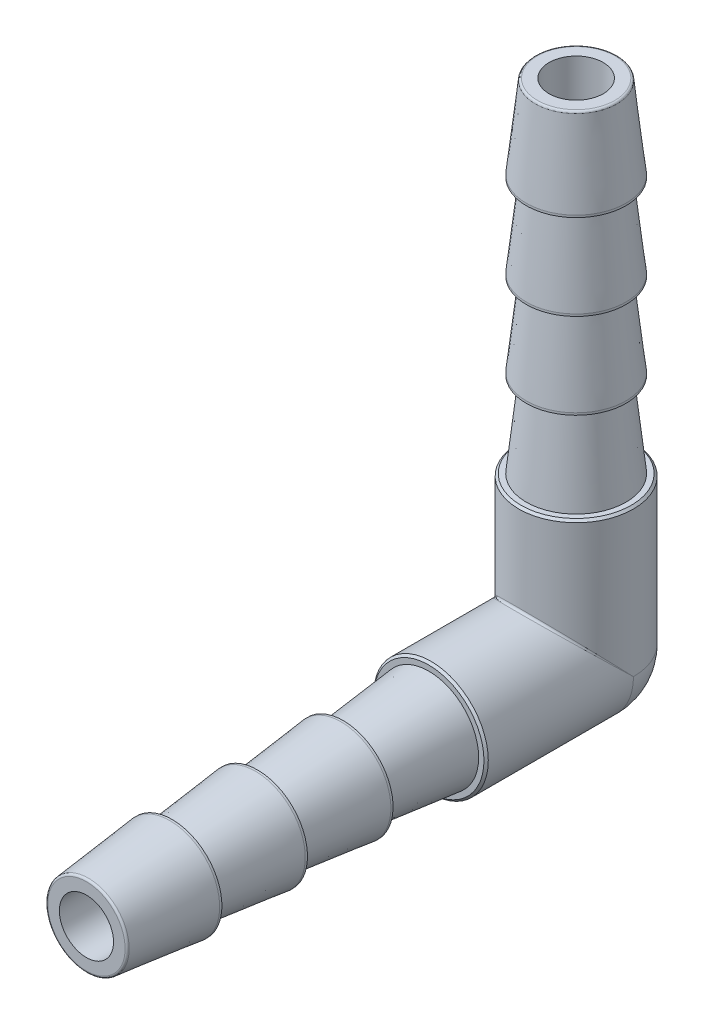
ISO-10303-21;
HEADER;
FILE_DESCRIPTION(('STEP AP214'),'2;1');
FILE_NAME('part.step','',(''),(''),'','','');
FILE_SCHEMA(('AUTOMOTIVE_DESIGN { 1 0 10303 214 1 1 1 1 }'));
ENDSEC;
DATA;
#1=APPLICATION_CONTEXT('core data for automotive mechanical design processes');
#2=APPLICATION_PROTOCOL_DEFINITION('international standard','automotive_design',2000,#1);
#3=PRODUCT_CONTEXT('',#1,'mechanical');
#4=PRODUCT('Part','Part','',(#3));
#5=PRODUCT_RELATED_PRODUCT_CATEGORY('part','',(#4));
#6=PRODUCT_DEFINITION_FORMATION('','',#4);
#7=PRODUCT_DEFINITION_CONTEXT('part definition',#1,'design');
#8=PRODUCT_DEFINITION('design','',#6,#7);
#9=PRODUCT_DEFINITION_SHAPE('','',#8);
#10=(LENGTH_UNIT() NAMED_UNIT(*) SI_UNIT(.MILLI.,.METRE.));
#11=(NAMED_UNIT(*) PLANE_ANGLE_UNIT() SI_UNIT($,.RADIAN.));
#12=(NAMED_UNIT(*) SI_UNIT($,.STERADIAN.) SOLID_ANGLE_UNIT());
#13=UNCERTAINTY_MEASURE_WITH_UNIT(LENGTH_MEASURE(1.E-05),#10,'distance_accuracy_value','');
#14=(GEOMETRIC_REPRESENTATION_CONTEXT(3) GLOBAL_UNCERTAINTY_ASSIGNED_CONTEXT((#13)) GLOBAL_UNIT_ASSIGNED_CONTEXT((#10,
#11,#12)) REPRESENTATION_CONTEXT('',''));
#15=CARTESIAN_POINT('',(0.,0.,0.));
#16=DIRECTION('',(0.,0.,1.));
#17=DIRECTION('',(1.,0.,0.));
#18=AXIS2_PLACEMENT_3D('',#15,#16,#17);
#19=CARTESIAN_POINT('',(0.,28.702,-1.00212497387476E-13));
#20=DIRECTION('',(0.,-1.,0.));
#21=DIRECTION('',(-1.,0.,0.));
#22=AXIS2_PLACEMENT_3D('',#19,#20,#21);
#23=PLANE('',#22);
#24=CARTESIAN_POINT('',(0.,28.702,-1.00212497387476E-13));
#25=DIRECTION('',(0.,-1.,0.));
#26=DIRECTION('',(0.,0.,-1.));
#27=AXIS2_PLACEMENT_3D('',#24,#25,#26);
#28=CIRCLE('',#27,2.26749802113188);
#29=CARTESIAN_POINT('',(0.,28.702,-2.26749802113198));
#30=VERTEX_POINT('',#29);
#31=EDGE_CURVE('E200',#30,#30,#28,.F.);
#32=ORIENTED_EDGE('',*,*,#31,.T.);
#33=EDGE_LOOP('',(#32));
#34=FACE_BOUND('',#33,.T.);
#35=CARTESIAN_POINT('',(0.,28.702,-1.00212497387476E-13));
#36=DIRECTION('',(0.,1.,0.));
#37=DIRECTION('',(1.,0.,0.));
#38=AXIS2_PLACEMENT_3D('',#35,#36,#37);
#39=CIRCLE('',#38,1.5875);
#40=CARTESIAN_POINT('',(1.5875,28.702,-1.00212497387476E-13));
#41=VERTEX_POINT('',#40);
#42=EDGE_CURVE('E85',#41,#41,#39,.T.);
#43=ORIENTED_EDGE('',*,*,#42,.F.);
#44=EDGE_LOOP('',(#43));
#45=FACE_BOUND('',#44,.T.);
#46=ADVANCED_FACE('F41',(#34,#45),#23,.F.);
#47=CARTESIAN_POINT('',(0.,0.,28.702));
#48=DIRECTION('',(0.,0.,1.));
#49=DIRECTION('',(1.,0.,0.));
#50=AXIS2_PLACEMENT_3D('',#47,#48,#49);
#51=CYLINDRICAL_SURFACE('',#50,1.5875);
#52=CARTESIAN_POINT('',(0.,0.,28.702));
#53=DIRECTION('',(0.,0.,1.));
#54=DIRECTION('',(1.,0.,0.));
#55=AXIS2_PLACEMENT_3D('',#52,#53,#54);
#56=CIRCLE('',#55,1.5875);
#57=CARTESIAN_POINT('',(1.5875,0.,28.702));
#58=VERTEX_POINT('',#57);
#59=EDGE_CURVE('E84',#58,#58,#56,.T.);
#60=ORIENTED_EDGE('',*,*,#59,.T.);
#61=EDGE_LOOP('',(#60));
#62=FACE_BOUND('',#61,.T.);
#63=CARTESIAN_POINT('',(0.,0.,0.));
#64=DIRECTION('',(0.,0.,1.));
#65=DIRECTION('',(1.,0.,0.));
#66=AXIS2_PLACEMENT_3D('',#63,#64,#65);
#67=CIRCLE('',#66,1.5875);
#68=CARTESIAN_POINT('',(-1.5875,0.,0.));
#69=VERTEX_POINT('',#68);
#70=CARTESIAN_POINT('',(1.5875,0.,0.));
#71=VERTEX_POINT('',#70);
#72=EDGE_CURVE('E82',#69,#71,#67,.T.);
#73=ORIENTED_EDGE('',*,*,#72,.F.);
#74=CARTESIAN_POINT('',(0.,0.,0.));
#75=DIRECTION('',(0.,-0.707106781186546,0.707106781186549));
#76=DIRECTION('',(0.,0.707106781186549,0.707106781186546));
#77=AXIS2_PLACEMENT_3D('',#74,#75,#76);
#78=ELLIPSE('',#77,2.24506403026728,1.5875);
#79=EDGE_CURVE('E71',#69,#71,#78,.F.);
#80=ORIENTED_EDGE('',*,*,#79,.T.);
#81=EDGE_LOOP('',(#73,#80));
#82=FACE_BOUND('',#81,.T.);
#83=ADVANCED_FACE('F87',(#62,#82),#51,.F.);
#84=CARTESIAN_POINT('',(0.,0.,28.702));
#85=DIRECTION('',(0.,0.,-1.));
#86=DIRECTION('',(-1.,0.,0.));
#87=AXIS2_PLACEMENT_3D('',#84,#85,#86);
#88=PLANE('',#87);
#89=CARTESIAN_POINT('',(0.,0.,28.702));
#90=DIRECTION('',(0.,0.,-1.));
#91=DIRECTION('',(-1.,0.,0.));
#92=AXIS2_PLACEMENT_3D('',#89,#90,#91);
#93=CIRCLE('',#92,2.26749802113188);
#94=CARTESIAN_POINT('',(-2.26749802113188,0.,28.702));
#95=VERTEX_POINT('',#94);
#96=EDGE_CURVE('E208',#95,#95,#93,.F.);
#97=ORIENTED_EDGE('',*,*,#96,.T.);
#98=EDGE_LOOP('',(#97));
#99=FACE_BOUND('',#98,.T.);
#100=ORIENTED_EDGE('',*,*,#59,.F.);
#101=EDGE_LOOP('',(#100));
#102=FACE_BOUND('',#101,.T.);
#103=ADVANCED_FACE('F245',(#99,#102),#88,.F.);
#104=CARTESIAN_POINT('',(0.,28.702,-1.00212497387476E-13));
#105=DIRECTION('',(0.,1.,0.));
#106=DIRECTION('',(1.,0.,0.));
#107=AXIS2_PLACEMENT_3D('',#104,#105,#106);
#108=CYLINDRICAL_SURFACE('',#107,3.35915);
#109=CARTESIAN_POINT('',(0.,8.509,0.));
#110=DIRECTION('',(0.,1.,0.));
#111=DIRECTION('',(0.,0.,1.));
#112=AXIS2_PLACEMENT_3D('',#109,#110,#111);
#113=CIRCLE('',#112,3.35915);
#114=CARTESIAN_POINT('',(0.,8.50900000000001,3.35914999999997));
#115=VERTEX_POINT('',#114);
#116=EDGE_CURVE('E78',#115,#115,#113,.F.);
#117=ORIENTED_EDGE('',*,*,#116,.T.);
#118=EDGE_LOOP('',(#117));
#119=FACE_BOUND('',#118,.T.);
#120=CARTESIAN_POINT('',(0.,0.,0.));
#121=DIRECTION('',(0.,1.,0.));
#122=DIRECTION('',(1.,0.,0.));
#123=AXIS2_PLACEMENT_3D('',#120,#121,#122);
#124=CIRCLE('',#123,3.35915);
#125=CARTESIAN_POINT('',(3.35915,0.,0.));
#126=VERTEX_POINT('',#125);
#127=CARTESIAN_POINT('',(-3.35915,0.,0.));
#128=VERTEX_POINT('',#127);
#129=EDGE_CURVE('E135',#126,#128,#124,.T.);
#130=ORIENTED_EDGE('',*,*,#129,.T.);
#131=CARTESIAN_POINT('',(0.,0.,0.));
#132=DIRECTION('',(0.,-0.693868509284947,0.720101723246573));
#133=DIRECTION('',(0.,0.720101723246574,0.693868509284947));
#134=AXIS2_PLACEMENT_3D('',#131,#132,#133);
#135=ELLIPSE('',#134,4.84119102546057,3.35915);
#136=EDGE_CURVE('E55',#128,#126,#135,.F.);
#137=ORIENTED_EDGE('',*,*,#136,.T.);
#138=EDGE_LOOP('',(#130,#137));
#139=FACE_BOUND('',#138,.T.);
#140=ADVANCED_FACE('F217',(#119,#139),#108,.T.);
#141=CARTESIAN_POINT('',(0.,0.,28.702));
#142=DIRECTION('',(0.,0.,1.));
#143=DIRECTION('',(1.,0.,0.));
#144=AXIS2_PLACEMENT_3D('',#141,#142,#143);
#145=CYLINDRICAL_SURFACE('',#144,3.35915);
#146=CARTESIAN_POINT('',(0.,0.,8.50899999999999));
#147=DIRECTION('',(0.,0.,1.));
#148=DIRECTION('',(1.,0.,0.));
#149=AXIS2_PLACEMENT_3D('',#146,#147,#148);
#150=CIRCLE('',#149,3.35915);
#151=CARTESIAN_POINT('',(3.35915,0.,8.50899999999999));
#152=VERTEX_POINT('',#151);
#153=EDGE_CURVE('E186',#152,#152,#150,.F.);
#154=ORIENTED_EDGE('',*,*,#153,.T.);
#155=EDGE_LOOP('',(#154));
#156=FACE_BOUND('',#155,.T.);
#157=CARTESIAN_POINT('',(0.,0.,0.));
#158=DIRECTION('',(0.,0.,1.));
#159=DIRECTION('',(1.,0.,0.));
#160=AXIS2_PLACEMENT_3D('',#157,#158,#159);
#161=CIRCLE('',#160,3.35915);
#162=EDGE_CURVE('E179',#128,#126,#161,.T.);
#163=ORIENTED_EDGE('',*,*,#162,.T.);
#164=CARTESIAN_POINT('',(0.,0.,0.));
#165=DIRECTION('',(0.,-0.720101723246571,0.69386850928495));
#166=DIRECTION('',(0.,0.69386850928495,0.720101723246571));
#167=AXIS2_PLACEMENT_3D('',#164,#165,#166);
#168=ELLIPSE('',#167,4.84119102546057,3.35915);
#169=EDGE_CURVE('E11',#126,#128,#168,.T.);
#170=ORIENTED_EDGE('',*,*,#169,.T.);
#171=EDGE_LOOP('',(#163,#170));
#172=FACE_BOUND('',#171,.T.);
#173=ADVANCED_FACE('F220',(#156,#172),#145,.T.);
#174=CARTESIAN_POINT('',(0.,0.,18.796));
#175=DIRECTION('',(0.,0.,-1.));
#176=DIRECTION('',(-1.,0.,0.));
#177=AXIS2_PLACEMENT_3D('',#174,#175,#176);
#178=CONICAL_SURFACE('',#177,2.921,0.109944462919684);
#179=CARTESIAN_POINT('',(0.,0.,23.6855));
#180=DIRECTION('',(0.,0.,-1.));
#181=DIRECTION('',(-1.,0.,0.));
#182=AXIS2_PLACEMENT_3D('',#179,#180,#181);
#183=CIRCLE('',#182,2.38125);
#184=CARTESIAN_POINT('',(-2.38125,0.,23.6855));
#185=VERTEX_POINT('',#184);
#186=EDGE_CURVE('E151',#185,#185,#183,.T.);
#187=ORIENTED_EDGE('',*,*,#186,.T.);
#188=EDGE_LOOP('',(#187));
#189=FACE_BOUND('',#188,.T.);
#190=CARTESIAN_POINT('',(0.,0.,18.796));
#191=DIRECTION('',(0.,0.,-1.));
#192=DIRECTION('',(-1.,0.,0.));
#193=AXIS2_PLACEMENT_3D('',#190,#191,#192);
#194=CIRCLE('',#193,2.921);
#195=CARTESIAN_POINT('',(-2.921,0.,18.796));
#196=VERTEX_POINT('',#195);
#197=EDGE_CURVE('E159',#196,#196,#194,.T.);
#198=ORIENTED_EDGE('',*,*,#197,.F.);
#199=EDGE_LOOP('',(#198));
#200=FACE_BOUND('',#199,.T.);
#201=ADVANCED_FACE('F272',(#189,#200),#178,.T.);
#202=CARTESIAN_POINT('',(0.,0.,3.61949999999999));
#203=DIRECTION('',(0.,0.,-1.));
#204=DIRECTION('',(-1.,0.,0.));
#205=AXIS2_PLACEMENT_3D('',#202,#203,#204);
#206=CYLINDRICAL_SURFACE('',#205,2.921);
#207=ORIENTED_EDGE('',*,*,#197,.T.);
#208=EDGE_LOOP('',(#207));
#209=FACE_BOUND('',#208,.T.);
#210=CARTESIAN_POINT('',(0.,0.,18.669));
#211=DIRECTION('',(0.,0.,-1.));
#212=DIRECTION('',(-1.,0.,0.));
#213=AXIS2_PLACEMENT_3D('',#210,#211,#212);
#214=CIRCLE('',#213,2.921);
#215=CARTESIAN_POINT('',(-2.921,0.,18.669));
#216=VERTEX_POINT('',#215);
#217=EDGE_CURVE('E155',#216,#216,#214,.T.);
#218=ORIENTED_EDGE('',*,*,#217,.F.);
#219=EDGE_LOOP('',(#218));
#220=FACE_BOUND('',#219,.T.);
#221=ADVANCED_FACE('F268',(#209,#220),#206,.T.);
#222=CARTESIAN_POINT('',(0.,2.38125,18.669));
#223=DIRECTION('',(0.,0.,-1.));
#224=DIRECTION('',(-1.,0.,0.));
#225=AXIS2_PLACEMENT_3D('',#222,#223,#224);
#226=PLANE('',#225);
#227=ORIENTED_EDGE('',*,*,#217,.T.);
#228=EDGE_LOOP('',(#227));
#229=FACE_BOUND('',#228,.T.);
#230=CARTESIAN_POINT('',(0.,0.,18.669));
#231=DIRECTION('',(0.,0.,-1.));
#232=DIRECTION('',(-1.,0.,0.));
#233=AXIS2_PLACEMENT_3D('',#230,#231,#232);
#234=CIRCLE('',#233,2.38125);
#235=CARTESIAN_POINT('',(-2.38125,0.,18.669));
#236=VERTEX_POINT('',#235);
#237=EDGE_CURVE('E139',#236,#236,#234,.T.);
#238=ORIENTED_EDGE('',*,*,#237,.F.);
#239=EDGE_LOOP('',(#238));
#240=FACE_BOUND('',#239,.T.);
#241=ADVANCED_FACE('F264',(#229,#240),#226,.T.);
#242=CARTESIAN_POINT('',(0.,0.,23.8125));
#243=DIRECTION('',(0.,0.,-1.));
#244=DIRECTION('',(-1.,0.,0.));
#245=AXIS2_PLACEMENT_3D('',#242,#243,#244);
#246=CONICAL_SURFACE('',#245,2.921,0.109944462919684);
#247=CARTESIAN_POINT('',(0.,0.,28.5889348336045));
#248=DIRECTION('',(0.,0.,-1.));
#249=DIRECTION('',(-1.,0.,0.));
#250=AXIS2_PLACEMENT_3D('',#247,#248,#249);
#251=CIRCLE('',#250,2.39373121966703);
#252=CARTESIAN_POINT('',(-2.39373121966703,0.,28.5889348336045));
#253=VERTEX_POINT('',#252);
#254=EDGE_CURVE('E204',#253,#253,#251,.T.);
#255=ORIENTED_EDGE('',*,*,#254,.T.);
#256=EDGE_LOOP('',(#255));
#257=FACE_BOUND('',#256,.T.);
#258=CARTESIAN_POINT('',(0.,0.,23.8125));
#259=DIRECTION('',(0.,0.,-1.));
#260=DIRECTION('',(-1.,0.,0.));
#261=AXIS2_PLACEMENT_3D('',#258,#259,#260);
#262=CIRCLE('',#261,2.921);
#263=CARTESIAN_POINT('',(-2.921,0.,23.8125));
#264=VERTEX_POINT('',#263);
#265=EDGE_CURVE('E167',#264,#264,#262,.T.);
#266=ORIENTED_EDGE('',*,*,#265,.F.);
#267=EDGE_LOOP('',(#266));
#268=FACE_BOUND('',#267,.T.);
#269=ADVANCED_FACE('F267',(#257,#268),#246,.T.);
#270=CARTESIAN_POINT('',(0.,0.,8.63599999999999));
#271=DIRECTION('',(0.,0.,-1.));
#272=DIRECTION('',(-1.,0.,0.));
#273=AXIS2_PLACEMENT_3D('',#270,#271,#272);
#274=CYLINDRICAL_SURFACE('',#273,2.921);
#275=ORIENTED_EDGE('',*,*,#265,.T.);
#276=EDGE_LOOP('',(#275));
#277=FACE_BOUND('',#276,.T.);
#278=CARTESIAN_POINT('',(0.,0.,23.6855));
#279=DIRECTION('',(0.,0.,-1.));
#280=DIRECTION('',(-1.,0.,0.));
#281=AXIS2_PLACEMENT_3D('',#278,#279,#280);
#282=CIRCLE('',#281,2.921);
#283=CARTESIAN_POINT('',(-2.921,0.,23.6855));
#284=VERTEX_POINT('',#283);
#285=EDGE_CURVE('E163',#284,#284,#282,.T.);
#286=ORIENTED_EDGE('',*,*,#285,.F.);
#287=EDGE_LOOP('',(#286));
#288=FACE_BOUND('',#287,.T.);
#289=ADVANCED_FACE('F279',(#277,#288),#274,.T.);
#290=CARTESIAN_POINT('',(0.,2.38125,23.6855));
#291=DIRECTION('',(0.,0.,-1.));
#292=DIRECTION('',(-1.,0.,0.));
#293=AXIS2_PLACEMENT_3D('',#290,#291,#292);
#294=PLANE('',#293);
#295=ORIENTED_EDGE('',*,*,#285,.T.);
#296=EDGE_LOOP('',(#295));
#297=FACE_BOUND('',#296,.T.);
#298=ORIENTED_EDGE('',*,*,#186,.F.);
#299=EDGE_LOOP('',(#298));
#300=FACE_BOUND('',#299,.T.);
#301=ADVANCED_FACE('F262',(#297,#300),#294,.T.);
#302=CARTESIAN_POINT('',(0.,0.,13.7795));
#303=DIRECTION('',(0.,0.,-1.));
#304=DIRECTION('',(-1.,0.,0.));
#305=AXIS2_PLACEMENT_3D('',#302,#303,#304);
#306=CONICAL_SURFACE('',#305,2.921,0.109944462919684);
#307=ORIENTED_EDGE('',*,*,#237,.T.);
#308=EDGE_LOOP('',(#307));
#309=FACE_BOUND('',#308,.T.);
#310=CARTESIAN_POINT('',(0.,0.,13.7795));
#311=DIRECTION('',(0.,0.,-1.));
#312=DIRECTION('',(-1.,0.,0.));
#313=AXIS2_PLACEMENT_3D('',#310,#311,#312);
#314=CIRCLE('',#313,2.921);
#315=CARTESIAN_POINT('',(-2.921,0.,13.7795));
#316=VERTEX_POINT('',#315);
#317=EDGE_CURVE('E147',#316,#316,#314,.T.);
#318=ORIENTED_EDGE('',*,*,#317,.F.);
#319=EDGE_LOOP('',(#318));
#320=FACE_BOUND('',#319,.T.);
#321=ADVANCED_FACE('F258',(#309,#320),#306,.T.);
#322=CARTESIAN_POINT('',(0.,0.,-1.39700000000001));
#323=DIRECTION('',(0.,0.,-1.));
#324=DIRECTION('',(-1.,0.,0.));
#325=AXIS2_PLACEMENT_3D('',#322,#323,#324);
#326=CYLINDRICAL_SURFACE('',#325,2.921);
#327=ORIENTED_EDGE('',*,*,#317,.T.);
#328=EDGE_LOOP('',(#327));
#329=FACE_BOUND('',#328,.T.);
#330=CARTESIAN_POINT('',(0.,0.,13.6525));
#331=DIRECTION('',(0.,0.,-1.));
#332=DIRECTION('',(-1.,0.,0.));
#333=AXIS2_PLACEMENT_3D('',#330,#331,#332);
#334=CIRCLE('',#333,2.921);
#335=CARTESIAN_POINT('',(-2.921,0.,13.6525));
#336=VERTEX_POINT('',#335);
#337=EDGE_CURVE('E143',#336,#336,#334,.T.);
#338=ORIENTED_EDGE('',*,*,#337,.F.);
#339=EDGE_LOOP('',(#338));
#340=FACE_BOUND('',#339,.T.);
#341=ADVANCED_FACE('F234',(#329,#340),#326,.T.);
#342=CARTESIAN_POINT('',(0.,2.38125,13.6525));
#343=DIRECTION('',(0.,0.,-1.));
#344=DIRECTION('',(-1.,0.,0.));
#345=AXIS2_PLACEMENT_3D('',#342,#343,#344);
#346=PLANE('',#345);
#347=ORIENTED_EDGE('',*,*,#337,.T.);
#348=EDGE_LOOP('',(#347));
#349=FACE_BOUND('',#348,.T.);
#350=CARTESIAN_POINT('',(0.,0.,13.6525));
#351=DIRECTION('',(0.,0.,1.));
#352=DIRECTION('',(1.,0.,0.));
#353=AXIS2_PLACEMENT_3D('',#350,#351,#352);
#354=CIRCLE('',#353,2.38125);
#355=CARTESIAN_POINT('',(2.38125,0.,13.6525));
#356=VERTEX_POINT('',#355);
#357=EDGE_CURVE('E175',#356,#356,#354,.T.);
#358=ORIENTED_EDGE('',*,*,#357,.T.);
#359=EDGE_LOOP('',(#358));
#360=FACE_BOUND('',#359,.T.);
#361=ADVANCED_FACE('F225',(#349,#360),#346,.T.);
#362=CARTESIAN_POINT('',(0.,0.,0.));
#363=DIRECTION('',(0.,0.,1.));
#364=DIRECTION('',(0.,1.,0.));
#365=AXIS2_PLACEMENT_3D('',#362,#363,#364);
#366=SPHERICAL_SURFACE('',#365,3.35915);
#367=ORIENTED_EDGE('',*,*,#162,.F.);
#368=ORIENTED_EDGE('',*,*,#129,.F.);
#369=EDGE_LOOP('',(#367,#368));
#370=FACE_BOUND('',#369,.T.);
#371=ADVANCED_FACE('F222',(#370),#366,.T.);
#372=CARTESIAN_POINT('',(0.,2.921,8.63599999999999));
#373=DIRECTION('',(0.,0.,1.));
#374=DIRECTION('',(1.,0.,0.));
#375=AXIS2_PLACEMENT_3D('',#372,#373,#374);
#376=PLANE('',#375);
#377=CARTESIAN_POINT('',(0.,0.,8.63599999999999));
#378=DIRECTION('',(0.,0.,1.));
#379=DIRECTION('',(1.,0.,0.));
#380=AXIS2_PLACEMENT_3D('',#377,#378,#379);
#381=CIRCLE('',#380,3.23214999999999);
#382=CARTESIAN_POINT('',(3.23214999999999,0.,8.63599999999999));
#383=VERTEX_POINT('',#382);
#384=EDGE_CURVE('E182',#383,#383,#381,.T.);
#385=ORIENTED_EDGE('',*,*,#384,.T.);
#386=EDGE_LOOP('',(#385));
#387=FACE_BOUND('',#386,.T.);
#388=CARTESIAN_POINT('',(0.,0.,8.63599999999999));
#389=DIRECTION('',(0.,0.,1.));
#390=DIRECTION('',(1.,0.,0.));
#391=AXIS2_PLACEMENT_3D('',#388,#389,#390);
#392=CIRCLE('',#391,2.921);
#393=CARTESIAN_POINT('',(2.921,0.,8.63599999999999));
#394=VERTEX_POINT('',#393);
#395=EDGE_CURVE('E171',#394,#394,#392,.T.);
#396=ORIENTED_EDGE('',*,*,#395,.F.);
#397=EDGE_LOOP('',(#396));
#398=FACE_BOUND('',#397,.T.);
#399=ADVANCED_FACE('F224',(#387,#398),#376,.T.);
#400=CARTESIAN_POINT('',(0.,0.,13.6525));
#401=DIRECTION('',(0.,0.,-1.));
#402=DIRECTION('',(-1.,0.,0.));
#403=AXIS2_PLACEMENT_3D('',#400,#401,#402);
#404=CONICAL_SURFACE('',#403,2.38125,0.10718259999368);
#405=ORIENTED_EDGE('',*,*,#395,.T.);
#406=EDGE_LOOP('',(#405));
#407=FACE_BOUND('',#406,.T.);
#408=ORIENTED_EDGE('',*,*,#357,.F.);
#409=EDGE_LOOP('',(#408));
#410=FACE_BOUND('',#409,.T.);
#411=ADVANCED_FACE('F231',(#407,#410),#404,.T.);
#412=CARTESIAN_POINT('',(0.,0.,8.63599999999999));
#413=DIRECTION('',(0.,0.,-1.));
#414=DIRECTION('',(-1.,0.,0.));
#415=AXIS2_PLACEMENT_3D('',#412,#413,#414);
#416=CONICAL_SURFACE('',#415,3.23214999999999,0.785398163397472);
#417=ORIENTED_EDGE('',*,*,#153,.F.);
#418=EDGE_LOOP('',(#417));
#419=FACE_BOUND('',#418,.T.);
#420=ORIENTED_EDGE('',*,*,#384,.F.);
#421=EDGE_LOOP('',(#420));
#422=FACE_BOUND('',#421,.T.);
#423=ADVANCED_FACE('F287',(#419,#422),#416,.T.);
#424=CARTESIAN_POINT('',(0.,13.6525,0.));
#425=DIRECTION('',(0.,-1.,0.));
#426=DIRECTION('',(-1.,0.,0.));
#427=AXIS2_PLACEMENT_3D('',#424,#425,#426);
#428=CONICAL_SURFACE('',#427,2.38125,0.10718259999368);
#429=CARTESIAN_POINT('',(0.,8.63599999999999,0.));
#430=DIRECTION('',(0.,1.,0.));
#431=DIRECTION('',(1.,0.,0.));
#432=AXIS2_PLACEMENT_3D('',#429,#430,#431);
#433=CIRCLE('',#432,2.921);
#434=CARTESIAN_POINT('',(2.921,8.63599999999999,0.));
#435=VERTEX_POINT('',#434);
#436=EDGE_CURVE('E127',#435,#435,#433,.T.);
#437=ORIENTED_EDGE('',*,*,#436,.T.);
#438=EDGE_LOOP('',(#437));
#439=FACE_BOUND('',#438,.T.);
#440=CARTESIAN_POINT('',(0.,13.6525,0.));
#441=DIRECTION('',(0.,1.,0.));
#442=DIRECTION('',(1.,0.,0.));
#443=AXIS2_PLACEMENT_3D('',#440,#441,#442);
#444=CIRCLE('',#443,2.38125);
#445=CARTESIAN_POINT('',(2.38125,13.6525,0.));
#446=VERTEX_POINT('',#445);
#447=EDGE_CURVE('E131',#446,#446,#444,.T.);
#448=ORIENTED_EDGE('',*,*,#447,.F.);
#449=EDGE_LOOP('',(#448));
#450=FACE_BOUND('',#449,.T.);
#451=ADVANCED_FACE('F250',(#439,#450),#428,.T.);
#452=CARTESIAN_POINT('',(0.,8.63599999999998,-2.92100000000003));
#453=DIRECTION('',(0.,1.,0.));
#454=DIRECTION('',(1.,0.,0.));
#455=AXIS2_PLACEMENT_3D('',#452,#453,#454);
#456=PLANE('',#455);
#457=CARTESIAN_POINT('',(0.,8.63599999999999,0.));
#458=DIRECTION('',(0.,1.,0.));
#459=DIRECTION('',(0.,0.,1.));
#460=AXIS2_PLACEMENT_3D('',#457,#458,#459);
#461=CIRCLE('',#460,3.23215000000001);
#462=CARTESIAN_POINT('',(0.,8.63600000000001,3.23214999999998));
#463=VERTEX_POINT('',#462);
#464=EDGE_CURVE('E190',#463,#463,#461,.T.);
#465=ORIENTED_EDGE('',*,*,#464,.T.);
#466=EDGE_LOOP('',(#465));
#467=FACE_BOUND('',#466,.T.);
#468=ORIENTED_EDGE('',*,*,#436,.F.);
#469=EDGE_LOOP('',(#468));
#470=FACE_BOUND('',#469,.T.);
#471=ADVANCED_FACE('F302',(#467,#470),#456,.T.);
#472=CARTESIAN_POINT('',(0.,13.7795,0.));
#473=DIRECTION('',(0.,-1.,0.));
#474=DIRECTION('',(-1.,0.,0.));
#475=AXIS2_PLACEMENT_3D('',#472,#473,#474);
#476=CONICAL_SURFACE('',#475,2.921,0.109944462919684);
#477=CARTESIAN_POINT('',(0.,18.669,0.));
#478=DIRECTION('',(0.,-1.,0.));
#479=DIRECTION('',(-1.,0.,0.));
#480=AXIS2_PLACEMENT_3D('',#477,#478,#479);
#481=CIRCLE('',#480,2.38125);
#482=CARTESIAN_POINT('',(-2.38125,18.669,0.));
#483=VERTEX_POINT('',#482);
#484=EDGE_CURVE('E89',#483,#483,#481,.T.);
#485=ORIENTED_EDGE('',*,*,#484,.T.);
#486=EDGE_LOOP('',(#485));
#487=FACE_BOUND('',#486,.T.);
#488=CARTESIAN_POINT('',(0.,13.7795,0.));
#489=DIRECTION('',(0.,-1.,0.));
#490=DIRECTION('',(-1.,0.,0.));
#491=AXIS2_PLACEMENT_3D('',#488,#489,#490);
#492=CIRCLE('',#491,2.921);
#493=CARTESIAN_POINT('',(-2.921,13.7795,0.));
#494=VERTEX_POINT('',#493);
#495=EDGE_CURVE('E103',#494,#494,#492,.T.);
#496=ORIENTED_EDGE('',*,*,#495,.F.);
#497=EDGE_LOOP('',(#496));
#498=FACE_BOUND('',#497,.T.);
#499=ADVANCED_FACE('F421',(#487,#498),#476,.T.);
#500=CARTESIAN_POINT('',(0.,-1.39700000000001,0.));
#501=DIRECTION('',(0.,-1.,0.));
#502=DIRECTION('',(-1.,0.,0.));
#503=AXIS2_PLACEMENT_3D('',#500,#501,#502);
#504=CYLINDRICAL_SURFACE('',#503,2.921);
#505=ORIENTED_EDGE('',*,*,#495,.T.);
#506=EDGE_LOOP('',(#505));
#507=FACE_BOUND('',#506,.T.);
#508=CARTESIAN_POINT('',(0.,13.6525,0.));
#509=DIRECTION('',(0.,-1.,0.));
#510=DIRECTION('',(-1.,0.,0.));
#511=AXIS2_PLACEMENT_3D('',#508,#509,#510);
#512=CIRCLE('',#511,2.921);
#513=CARTESIAN_POINT('',(-2.921,13.6525,0.));
#514=VERTEX_POINT('',#513);
#515=EDGE_CURVE('E95',#514,#514,#512,.T.);
#516=ORIENTED_EDGE('',*,*,#515,.F.);
#517=EDGE_LOOP('',(#516));
#518=FACE_BOUND('',#517,.T.);
#519=ADVANCED_FACE('F431',(#507,#518),#504,.T.);
#520=CARTESIAN_POINT('',(0.,13.6525,-2.38125000000005));
#521=DIRECTION('',(0.,-1.,0.));
#522=DIRECTION('',(-1.,0.,0.));
#523=AXIS2_PLACEMENT_3D('',#520,#521,#522);
#524=PLANE('',#523);
#525=ORIENTED_EDGE('',*,*,#515,.T.);
#526=EDGE_LOOP('',(#525));
#527=FACE_BOUND('',#526,.T.);
#528=ORIENTED_EDGE('',*,*,#447,.T.);
#529=EDGE_LOOP('',(#528));
#530=FACE_BOUND('',#529,.T.);
#531=ADVANCED_FACE('F442',(#527,#530),#524,.T.);
#532=CARTESIAN_POINT('',(0.,23.8125,0.));
#533=DIRECTION('',(0.,-1.,0.));
#534=DIRECTION('',(-1.,0.,0.));
#535=AXIS2_PLACEMENT_3D('',#532,#533,#534);
#536=CONICAL_SURFACE('',#535,2.921,0.109944462919684);
#537=CARTESIAN_POINT('',(0.,28.5889348336045,0.));
#538=DIRECTION('',(0.,-1.,0.));
#539=DIRECTION('',(0.,0.,-1.));
#540=AXIS2_PLACEMENT_3D('',#537,#538,#539);
#541=CIRCLE('',#540,2.39373121966703);
#542=CARTESIAN_POINT('',(0.,28.5889348336045,-2.39373121966713));
#543=VERTEX_POINT('',#542);
#544=EDGE_CURVE('E77',#543,#543,#541,.T.);
#545=ORIENTED_EDGE('',*,*,#544,.T.);
#546=EDGE_LOOP('',(#545));
#547=FACE_BOUND('',#546,.T.);
#548=CARTESIAN_POINT('',(0.,23.8125,0.));
#549=DIRECTION('',(0.,-1.,0.));
#550=DIRECTION('',(-1.,0.,0.));
#551=AXIS2_PLACEMENT_3D('',#548,#549,#550);
#552=CIRCLE('',#551,2.921);
#553=CARTESIAN_POINT('',(-2.921,23.8125,0.));
#554=VERTEX_POINT('',#553);
#555=EDGE_CURVE('E123',#554,#554,#552,.T.);
#556=ORIENTED_EDGE('',*,*,#555,.F.);
#557=EDGE_LOOP('',(#556));
#558=FACE_BOUND('',#557,.T.);
#559=ADVANCED_FACE('F452',(#547,#558),#536,.T.);
#560=CARTESIAN_POINT('',(0.,8.63599999999999,0.));
#561=DIRECTION('',(0.,-1.,0.));
#562=DIRECTION('',(-1.,0.,0.));
#563=AXIS2_PLACEMENT_3D('',#560,#561,#562);
#564=CYLINDRICAL_SURFACE('',#563,2.921);
#565=ORIENTED_EDGE('',*,*,#555,.T.);
#566=EDGE_LOOP('',(#565));
#567=FACE_BOUND('',#566,.T.);
#568=CARTESIAN_POINT('',(0.,23.6855,0.));
#569=DIRECTION('',(0.,-1.,0.));
#570=DIRECTION('',(-1.,0.,0.));
#571=AXIS2_PLACEMENT_3D('',#568,#569,#570);
#572=CIRCLE('',#571,2.921);
#573=CARTESIAN_POINT('',(-2.921,23.6855,0.));
#574=VERTEX_POINT('',#573);
#575=EDGE_CURVE('E119',#574,#574,#572,.T.);
#576=ORIENTED_EDGE('',*,*,#575,.F.);
#577=EDGE_LOOP('',(#576));
#578=FACE_BOUND('',#577,.T.);
#579=ADVANCED_FACE('F460',(#567,#578),#564,.T.);
#580=CARTESIAN_POINT('',(0.,23.6855,-2.38125000000008));
#581=DIRECTION('',(0.,-1.,0.));
#582=DIRECTION('',(-1.,0.,0.));
#583=AXIS2_PLACEMENT_3D('',#580,#581,#582);
#584=PLANE('',#583);
#585=ORIENTED_EDGE('',*,*,#575,.T.);
#586=EDGE_LOOP('',(#585));
#587=FACE_BOUND('',#586,.T.);
#588=CARTESIAN_POINT('',(0.,23.6855,0.));
#589=DIRECTION('',(0.,-1.,0.));
#590=DIRECTION('',(-1.,0.,0.));
#591=AXIS2_PLACEMENT_3D('',#588,#589,#590);
#592=CIRCLE('',#591,2.38125);
#593=CARTESIAN_POINT('',(-2.38125,23.6855,0.));
#594=VERTEX_POINT('',#593);
#595=EDGE_CURVE('E107',#594,#594,#592,.T.);
#596=ORIENTED_EDGE('',*,*,#595,.F.);
#597=EDGE_LOOP('',(#596));
#598=FACE_BOUND('',#597,.T.);
#599=ADVANCED_FACE('F465',(#587,#598),#584,.T.);
#600=CARTESIAN_POINT('',(0.,18.796,0.));
#601=DIRECTION('',(0.,-1.,0.));
#602=DIRECTION('',(-1.,0.,0.));
#603=AXIS2_PLACEMENT_3D('',#600,#601,#602);
#604=CONICAL_SURFACE('',#603,2.921,0.109944462919684);
#605=ORIENTED_EDGE('',*,*,#595,.T.);
#606=EDGE_LOOP('',(#605));
#607=FACE_BOUND('',#606,.T.);
#608=CARTESIAN_POINT('',(0.,18.796,0.));
#609=DIRECTION('',(0.,-1.,0.));
#610=DIRECTION('',(-1.,0.,0.));
#611=AXIS2_PLACEMENT_3D('',#608,#609,#610);
#612=CIRCLE('',#611,2.921);
#613=CARTESIAN_POINT('',(-2.921,18.796,0.));
#614=VERTEX_POINT('',#613);
#615=EDGE_CURVE('E115',#614,#614,#612,.T.);
#616=ORIENTED_EDGE('',*,*,#615,.F.);
#617=EDGE_LOOP('',(#616));
#618=FACE_BOUND('',#617,.T.);
#619=ADVANCED_FACE('F474',(#607,#618),#604,.T.);
#620=CARTESIAN_POINT('',(0.,3.61949999999999,0.));
#621=DIRECTION('',(0.,-1.,0.));
#622=DIRECTION('',(-1.,0.,0.));
#623=AXIS2_PLACEMENT_3D('',#620,#621,#622);
#624=CYLINDRICAL_SURFACE('',#623,2.921);
#625=ORIENTED_EDGE('',*,*,#615,.T.);
#626=EDGE_LOOP('',(#625));
#627=FACE_BOUND('',#626,.T.);
#628=CARTESIAN_POINT('',(0.,18.669,0.));
#629=DIRECTION('',(0.,-1.,0.));
#630=DIRECTION('',(-1.,0.,0.));
#631=AXIS2_PLACEMENT_3D('',#628,#629,#630);
#632=CIRCLE('',#631,2.921);
#633=CARTESIAN_POINT('',(-2.921,18.669,0.));
#634=VERTEX_POINT('',#633);
#635=EDGE_CURVE('E111',#634,#634,#632,.T.);
#636=ORIENTED_EDGE('',*,*,#635,.F.);
#637=EDGE_LOOP('',(#636));
#638=FACE_BOUND('',#637,.T.);
#639=ADVANCED_FACE('F483',(#627,#638),#624,.T.);
#640=CARTESIAN_POINT('',(0.,18.669,-2.38125000000007));
#641=DIRECTION('',(0.,-1.,0.));
#642=DIRECTION('',(-1.,0.,0.));
#643=AXIS2_PLACEMENT_3D('',#640,#641,#642);
#644=PLANE('',#643);
#645=ORIENTED_EDGE('',*,*,#635,.T.);
#646=EDGE_LOOP('',(#645));
#647=FACE_BOUND('',#646,.T.);
#648=ORIENTED_EDGE('',*,*,#484,.F.);
#649=EDGE_LOOP('',(#648));
#650=FACE_BOUND('',#649,.T.);
#651=ADVANCED_FACE('F311',(#647,#650),#644,.T.);
#652=CARTESIAN_POINT('',(0.,8.63599999999999,0.));
#653=DIRECTION('',(0.,-1.,0.));
#654=DIRECTION('',(0.,0.,-1.));
#655=AXIS2_PLACEMENT_3D('',#652,#653,#654);
#656=CONICAL_SURFACE('',#655,3.23215000000001,0.785398163397447);
#657=ORIENTED_EDGE('',*,*,#116,.F.);
#658=EDGE_LOOP('',(#657));
#659=FACE_BOUND('',#658,.T.);
#660=ORIENTED_EDGE('',*,*,#464,.F.);
#661=EDGE_LOOP('',(#660));
#662=FACE_BOUND('',#661,.T.);
#663=ADVANCED_FACE('F308',(#659,#662),#656,.T.);
#664=CARTESIAN_POINT('',(0.,0.,0.));
#665=DIRECTION('',(0.,0.,1.));
#666=DIRECTION('',(0.,1.,0.));
#667=AXIS2_PLACEMENT_3D('',#664,#665,#666);
#668=SPHERICAL_SURFACE('',#667,1.5875);
#669=CARTESIAN_POINT('',(0.,0.,0.));
#670=DIRECTION('',(0.,1.,0.));
#671=DIRECTION('',(1.,0.,0.));
#672=AXIS2_PLACEMENT_3D('',#669,#670,#671);
#673=CIRCLE('',#672,1.5875);
#674=EDGE_CURVE('E61',#71,#69,#673,.T.);
#675=ORIENTED_EDGE('',*,*,#674,.T.);
#676=ORIENTED_EDGE('',*,*,#72,.T.);
#677=EDGE_LOOP('',(#675,#676));
#678=FACE_BOUND('',#677,.T.);
#679=ADVANCED_FACE('F81',(#678),#668,.F.);
#680=CARTESIAN_POINT('',(0.,28.702,-1.00212497387476E-13));
#681=DIRECTION('',(0.,1.,0.));
#682=DIRECTION('',(1.,0.,0.));
#683=AXIS2_PLACEMENT_3D('',#680,#681,#682);
#684=CYLINDRICAL_SURFACE('',#683,1.5875);
#685=ORIENTED_EDGE('',*,*,#42,.T.);
#686=EDGE_LOOP('',(#685));
#687=FACE_BOUND('',#686,.T.);
#688=ORIENTED_EDGE('',*,*,#674,.F.);
#689=ORIENTED_EDGE('',*,*,#79,.F.);
#690=EDGE_LOOP('',(#688,#689));
#691=FACE_BOUND('',#690,.T.);
#692=ADVANCED_FACE('F72',(#687,#691),#684,.F.);
#693=CARTESIAN_POINT('',(0.,28.575,0.));
#694=DIRECTION('',(0.,-1.,0.));
#695=DIRECTION('',(0.,0.,-1.));
#696=AXIS2_PLACEMENT_3D('',#693,#694,#695);
#697=TOROIDAL_SURFACE('',#696,2.26749802113188,0.127);
#698=ORIENTED_EDGE('',*,*,#31,.F.);
#699=EDGE_LOOP('',(#698));
#700=FACE_BOUND('',#699,.T.);
#701=ORIENTED_EDGE('',*,*,#544,.F.);
#702=EDGE_LOOP('',(#701));
#703=FACE_BOUND('',#702,.T.);
#704=ADVANCED_FACE('F313',(#700,#703),#697,.T.);
#705=CARTESIAN_POINT('',(0.,0.,28.575));
#706=DIRECTION('',(0.,0.,-1.));
#707=DIRECTION('',(-1.,0.,0.));
#708=AXIS2_PLACEMENT_3D('',#705,#706,#707);
#709=TOROIDAL_SURFACE('',#708,2.26749802113188,0.127);
#710=ORIENTED_EDGE('',*,*,#96,.F.);
#711=EDGE_LOOP('',(#710));
#712=FACE_BOUND('',#711,.T.);
#713=ORIENTED_EDGE('',*,*,#254,.F.);
#714=EDGE_LOOP('',(#713));
#715=FACE_BOUND('',#714,.T.);
#716=ADVANCED_FACE('F315',(#712,#715),#709,.T.);
#717=CARTESIAN_POINT('',(-3.35915,0.,0.));
#718=CARTESIAN_POINT('',(-3.35915,0.,0.));
#719=CARTESIAN_POINT('',(-3.35915,0.,0.));
#720=CARTESIAN_POINT('',(-3.35909112207846,0.151873243115897,0.146340520233714));
#721=CARTESIAN_POINT('',(-3.35927936894317,0.149136181476021,0.14913618147602));
#722=CARTESIAN_POINT('',(-3.35909112207846,0.146340520233715,0.151873243115896));
#723=CARTESIAN_POINT('',(-3.34958232212336,0.303785264711497,0.29271840625206));
#724=CARTESIAN_POINT('',(-3.34921321859481,0.29868348059761,0.298683480597609));
#725=CARTESIAN_POINT('',(-3.34958232212336,0.292718406252061,0.303785264711495));
#726=CARTESIAN_POINT('',(-3.31140463566736,0.604996908310628,0.582956948080731));
#727=CARTESIAN_POINT('',(-3.30950367025516,0.594244454861791,0.594244454861789));
#728=CARTESIAN_POINT('',(-3.31140463566736,0.582956948080733,0.604996908310626));
#729=CARTESIAN_POINT('',(-3.28289929483332,0.754307760063912,0.726828424542456));
#730=CARTESIAN_POINT('',(-3.27980360176518,0.741104088397564,0.741104088397561));
#731=CARTESIAN_POINT('',(-3.28289929483332,0.726828424542459,0.75430776006391));
#732=CARTESIAN_POINT('',(-3.20712107105657,1.04777430268638,1.00960401843551));
#733=CARTESIAN_POINT('',(-3.20129517844799,1.02863930627667,1.02863930627667));
#734=CARTESIAN_POINT('',(-3.20712107105657,1.00960401843551,1.04777430268637));
#735=CARTESIAN_POINT('',(-3.16017099470676,1.19197445491355,1.14855097750322));
#736=CARTESIAN_POINT('',(-3.15237565539776,1.17015016751049,1.17015016751049));
#737=CARTESIAN_POINT('',(-3.16017099470676,1.14855097750322,1.19197445491355));
#738=CARTESIAN_POINT('',(-3.04812615757196,1.47270826473563,1.41905769042832));
#739=CARTESIAN_POINT('',(-3.0364656812141,1.44445207258426,1.44445207258426));
#740=CARTESIAN_POINT('',(-3.04812615757196,1.41905769042832,1.47270826473563));
#741=CARTESIAN_POINT('',(-2.98350687190152,1.60934327343182,1.55071510317929));
#742=CARTESIAN_POINT('',(-2.9693138091688,1.57805039203552,1.57805039203552));
#743=CARTESIAN_POINT('',(-2.98350687190152,1.55071510317929,1.60934327343181));
#744=CARTESIAN_POINT('',(-2.83707967998503,1.87255003697037,1.80433327788219));
#745=CARTESIAN_POINT('',(-2.81829416392885,1.83414805492728,1.83414805492728));
#746=CARTESIAN_POINT('',(-2.83707967998503,1.80433327788219,1.87255003697036));
#747=CARTESIAN_POINT('',(-2.75588435788248,1.99930367366336,1.92646929575212));
#748=CARTESIAN_POINT('',(-2.73422871690858,1.9574037515793,1.95740375157929));
#749=CARTESIAN_POINT('',(-2.75588435788248,1.92646929575213,1.99930367366335));
#750=CARTESIAN_POINT('',(-2.57755467659268,2.2404930937976,2.15887221606362));
#751=CARTESIAN_POINT('',(-2.55110570100342,2.19066364289225,2.19066364289224));
#752=CARTESIAN_POINT('',(-2.57755467659268,2.15887221606363,2.24049309379759));
#753=CARTESIAN_POINT('',(-2.48114310382206,2.35521390603771,2.26941376374125));
#754=CARTESIAN_POINT('',(-2.45184450329387,2.30133931593144,2.30133931593143));
#755=CARTESIAN_POINT('',(-2.48114310382206,2.26941376374125,2.3552139060377));
#756=CARTESIAN_POINT('',(-2.27392247296093,2.57026616293229,2.4766316943373));
#757=CARTESIAN_POINT('',(-2.24037177259312,2.5075931223798,2.50759312237979));
#758=CARTESIAN_POINT('',(-2.27392247296093,2.4766316943373,2.57026616293228));
#759=CARTESIAN_POINT('',(-2.16390175954293,2.67100241368722,2.57369813632156));
#760=CARTESIAN_POINT('',(-2.12800735230348,2.60371597586804,2.60371597586803));
#761=CARTESIAN_POINT('',(-2.16390175954293,2.57369813632157,2.67100241368721));
#762=CARTESIAN_POINT('',(-1.93128810440664,2.8562364176836,2.75218408917053));
#763=CARTESIAN_POINT('',(-1.89262038698515,2.77941714328961,2.7794171432896));
#764=CARTESIAN_POINT('',(-1.93128810440664,2.75218408917054,2.85623641768359));
#765=CARTESIAN_POINT('',(-1.80948253772253,2.9412605395513,2.83411079311955));
#766=CARTESIAN_POINT('',(-1.76958661463686,2.85937175787162,2.85937175787161));
#767=CARTESIAN_POINT('',(-1.80948253772253,2.83411079311956,2.94126053955129));
#768=CARTESIAN_POINT('',(-1.55540471505887,3.0934909161729,2.98079543653089));
#769=CARTESIAN_POINT('',(-1.51526108312241,3.00177821037198,3.00177821037197));
#770=CARTESIAN_POINT('',(-1.55540471505887,2.9807954365309,3.09349091617289));
#771=CARTESIAN_POINT('',(-1.42383228935736,3.16131824444735,3.04615182388459));
#772=CARTESIAN_POINT('',(-1.38422237497469,3.06441362153061,3.0644136215306));
#773=CARTESIAN_POINT('',(-1.42383228935736,3.0461518238846,3.16131824444734));
#774=CARTESIAN_POINT('',(-1.15259667614904,3.27790574924167,3.15849206074469));
#775=CARTESIAN_POINT('',(-1.11616378471741,3.17175247185516,3.17175247185515));
#776=CARTESIAN_POINT('',(-1.15259667614904,3.1584920607447,3.27790574924165));
#777=CARTESIAN_POINT('',(-1.01345600777828,3.32731150382377,3.20609796998683));
#778=CARTESIAN_POINT('',(-0.979787970209523,3.2164630615941,3.21646306159409));
#779=CARTESIAN_POINT('',(-1.01345600777828,3.20609796998684,3.32731150382376));
#780=CARTESIAN_POINT('',(-0.729693118200869,3.40621054963183,3.28212273361608));
#781=CARTESIAN_POINT('',(-0.702935468680488,3.28796193892413,3.28796193892411));
#782=CARTESIAN_POINT('',(-0.729693118200869,3.2821227336161,3.40621054963181));
#783=CARTESIAN_POINT('',(-0.585360936555086,3.43625719840248,3.31107478680311));
#784=CARTESIAN_POINT('',(-0.56356156848716,3.31465308980736,3.31465308980735));
#785=CARTESIAN_POINT('',(-0.585360936555086,3.31107478680312,3.43625719840247));
#786=CARTESIAN_POINT('',(-0.293963374363167,3.47606455582328,3.34943196726869));
#787=CARTESIAN_POINT('',(-0.282071886500323,3.35029294201457,3.35029294201456));
#788=CARTESIAN_POINT('',(-0.293963374363167,3.3494319672687,3.47606455582327));
#789=CARTESIAN_POINT('',(-0.146981687181584,3.48615,3.35914999999999));
#790=CARTESIAN_POINT('',(-0.141447499631226,3.35915,3.35914999999999));
#791=CARTESIAN_POINT('',(-0.146981687181584,3.35915,3.48614999999999));
#792=CARTESIAN_POINT('',(0.146981687181583,3.48615,3.35914999999999));
#793=CARTESIAN_POINT('',(0.141447499631226,3.35915,3.35914999999999));
#794=CARTESIAN_POINT('',(0.146981687181583,3.35915,3.48614999999999));
#795=CARTESIAN_POINT('',(0.293963374363167,3.47606455582328,3.34943196726869));
#796=CARTESIAN_POINT('',(0.282071886500323,3.35029294201457,3.35029294201456));
#797=CARTESIAN_POINT('',(0.293963374363167,3.3494319672687,3.47606455582327));
#798=CARTESIAN_POINT('',(0.585360936555085,3.43625719840248,3.31107478680311));
#799=CARTESIAN_POINT('',(0.563561568487159,3.31465308980736,3.31465308980735));
#800=CARTESIAN_POINT('',(0.585360936555085,3.31107478680312,3.43625719840247));
#801=CARTESIAN_POINT('',(0.729693118200867,3.40621054963183,3.28212273361608));
#802=CARTESIAN_POINT('',(0.702935468680487,3.28796193892413,3.28796193892411));
#803=CARTESIAN_POINT('',(0.729693118200867,3.2821227336161,3.40621054963182));
#804=CARTESIAN_POINT('',(1.01345600777828,3.32731150382377,3.20609796998683));
#805=CARTESIAN_POINT('',(0.979787970209521,3.2164630615941,3.21646306159409));
#806=CARTESIAN_POINT('',(1.01345600777828,3.20609796998684,3.32731150382376));
#807=CARTESIAN_POINT('',(1.15259667614904,3.27790574924167,3.15849206074469));
#808=CARTESIAN_POINT('',(1.11616378471741,3.17175247185516,3.17175247185515));
#809=CARTESIAN_POINT('',(1.15259667614904,3.1584920607447,3.27790574924165));
#810=CARTESIAN_POINT('',(1.42383228935736,3.16131824444735,3.04615182388459));
#811=CARTESIAN_POINT('',(1.38422237497469,3.06441362153061,3.0644136215306));
#812=CARTESIAN_POINT('',(1.42383228935736,3.0461518238846,3.16131824444734));
#813=CARTESIAN_POINT('',(1.55540471505887,3.0934909161729,2.98079543653089));
#814=CARTESIAN_POINT('',(1.5152610831224,3.00177821037198,3.00177821037197));
#815=CARTESIAN_POINT('',(1.55540471505887,2.9807954365309,3.09349091617288));
#816=CARTESIAN_POINT('',(1.80948253772253,2.9412605395513,2.83411079311955));
#817=CARTESIAN_POINT('',(1.76958661463686,2.85937175787162,2.85937175787161));
#818=CARTESIAN_POINT('',(1.80948253772253,2.83411079311956,2.94126053955129));
#819=CARTESIAN_POINT('',(1.93128810440664,2.8562364176836,2.75218408917053));
#820=CARTESIAN_POINT('',(1.89262038698515,2.77941714328961,2.7794171432896));
#821=CARTESIAN_POINT('',(1.93128810440664,2.75218408917054,2.85623641768359));
#822=CARTESIAN_POINT('',(2.16390175954293,2.67100241368722,2.57369813632156));
#823=CARTESIAN_POINT('',(2.12800735230348,2.60371597586804,2.60371597586803));
#824=CARTESIAN_POINT('',(2.16390175954293,2.57369813632157,2.67100241368721));
#825=CARTESIAN_POINT('',(2.27392247296093,2.57026616293229,2.4766316943373));
#826=CARTESIAN_POINT('',(2.24037177259312,2.5075931223798,2.50759312237979));
#827=CARTESIAN_POINT('',(2.27392247296093,2.4766316943373,2.57026616293228));
#828=CARTESIAN_POINT('',(2.48114310382206,2.35521390603771,2.26941376374125));
#829=CARTESIAN_POINT('',(2.45184450329387,2.30133931593144,2.30133931593143));
#830=CARTESIAN_POINT('',(2.48114310382206,2.26941376374125,2.3552139060377));
#831=CARTESIAN_POINT('',(2.57755467659268,2.2404930937976,2.15887221606362));
#832=CARTESIAN_POINT('',(2.55110570100342,2.19066364289225,2.19066364289224));
#833=CARTESIAN_POINT('',(2.57755467659268,2.15887221606363,2.2404930937976));
#834=CARTESIAN_POINT('',(2.75588435788247,1.99930367366336,1.92646929575212));
#835=CARTESIAN_POINT('',(2.73422871690858,1.9574037515793,1.95740375157929));
#836=CARTESIAN_POINT('',(2.75588435788247,1.92646929575213,1.99930367366335));
#837=CARTESIAN_POINT('',(2.83707967998503,1.87255003697037,1.80433327788219));
#838=CARTESIAN_POINT('',(2.81829416392885,1.83414805492728,1.83414805492728));
#839=CARTESIAN_POINT('',(2.83707967998503,1.80433327788219,1.87255003697036));
#840=CARTESIAN_POINT('',(2.98350687190152,1.60934327343182,1.55071510317929));
#841=CARTESIAN_POINT('',(2.9693138091688,1.57805039203552,1.57805039203552));
#842=CARTESIAN_POINT('',(2.98350687190152,1.55071510317929,1.60934327343181));
#843=CARTESIAN_POINT('',(3.04812615757195,1.47270826473563,1.41905769042832));
#844=CARTESIAN_POINT('',(3.0364656812141,1.44445207258426,1.44445207258426));
#845=CARTESIAN_POINT('',(3.04812615757195,1.41905769042832,1.47270826473563));
#846=CARTESIAN_POINT('',(3.16017099470676,1.19197445491356,1.14855097750322));
#847=CARTESIAN_POINT('',(3.15237565539776,1.17015016751049,1.17015016751049));
#848=CARTESIAN_POINT('',(3.16017099470676,1.14855097750323,1.19197445491355));
#849=CARTESIAN_POINT('',(3.20712107105657,1.04777430268638,1.00960401843551));
#850=CARTESIAN_POINT('',(3.20129517844799,1.02863930627667,1.02863930627667));
#851=CARTESIAN_POINT('',(3.20712107105657,1.00960401843551,1.04777430268638));
#852=CARTESIAN_POINT('',(3.28289929483332,0.754307760063914,0.726828424542458));
#853=CARTESIAN_POINT('',(3.27980360176518,0.741104088397565,0.741104088397563));
#854=CARTESIAN_POINT('',(3.28289929483332,0.72682842454246,0.754307760063912));
#855=CARTESIAN_POINT('',(3.31140463566736,0.604996908310629,0.582956948080732));
#856=CARTESIAN_POINT('',(3.30950367025516,0.594244454861793,0.594244454861791));
#857=CARTESIAN_POINT('',(3.31140463566736,0.582956948080734,0.604996908310627));
#858=CARTESIAN_POINT('',(3.34958232212336,0.303785264711498,0.292718406252062));
#859=CARTESIAN_POINT('',(3.34921321859481,0.298683480597611,0.29868348059761));
#860=CARTESIAN_POINT('',(3.34958232212336,0.292718406252063,0.303785264711497));
#861=CARTESIAN_POINT('',(3.35909112207846,0.151873243115898,0.146340520233715));
#862=CARTESIAN_POINT('',(3.35927936894317,0.149136181476022,0.149136181476021));
#863=CARTESIAN_POINT('',(3.35909112207846,0.146340520233716,0.151873243115897));
#864=CARTESIAN_POINT('',(3.35915,0.,0.));
#865=CARTESIAN_POINT('',(3.35915,0.,0.));
#866=CARTESIAN_POINT('',(3.35915,0.,0.));
#867=(BOUNDED_SURFACE() B_SPLINE_SURFACE(3,2,((#717,#718,#719),(#720,#721,#722),(#723,#724,
#725),(#726,#727,#728),(#729,#730,#731),(#732,#733,#734),(#735,#736,#737),(#738,#739,#740),
(#741,#742,#743),(#744,#745,#746),(#747,#748,#749),(#750,#751,#752),(#753,#754,#755),(#756,#757,
#758),(#759,#760,#761),(#762,#763,#764),(#765,#766,#767),(#768,#769,#770),(#771,#772,#773),
(#774,#775,#776),(#777,#778,#779),(#780,#781,#782),(#783,#784,#785),(#786,#787,#788),(#789,#790,
#791),(#792,#793,#794),(#795,#796,#797),(#798,#799,#800),(#801,#802,#803),(#804,#805,#806),
(#807,#808,#809),(#810,#811,#812),(#813,#814,#815),(#816,#817,#818),(#819,#820,#821),(#822,#823,
#824),(#825,#826,#827),(#828,#829,#830),(#831,#832,#833),(#834,#835,#836),(#837,#838,#839),
(#840,#841,#842),(#843,#844,#845),(#846,#847,#848),(#849,#850,#851),(#852,#853,#854),(#855,#856,
#857),(#858,#859,#860),(#861,#862,#863),(#864,#865,#866)),.UNSPECIFIED.,.F.,.F.,
.F.) B_SPLINE_SURFACE_WITH_KNOTS((4,2,2,2,2,2,2,2,2,2,2,2,2,2,2,2,2,2,2,2,2,2,2,2,4),(3,3),(0.,
0.64420584722866,1.28293601409129,1.91095278897847,2.52349875127932,3.11654733556209,
3.68706391040277,4.23327526979272,4.75493549251892,5.25355704777248,5.73254654844537,
6.19715367843176,6.65413818330141,7.11112268817106,7.57572981815745,8.05471931883033,
8.5533408740839,9.0750010968101,9.62121245620004,10.1917290310407,10.7847776153235,
11.3973235776243,12.0253403525115,12.6640705193742,13.3082763666028),(0.,1.),
.UNSPECIFIED.) GEOMETRIC_REPRESENTATION_ITEM() RATIONAL_B_SPLINE_SURFACE(((1.,1.,1.),(1.,
1.00000566557019,1.),(1.,0.998576699090688,1.),(1.,0.992910721279765,1.),(1.,0.988697681267574,
1.),(1.,0.97761712883305,1.),(1.,0.970795325018433,1.),(1.,0.954789124900482,1.),(1.,
0.945667069465631,1.),(1.,0.92548796875733,1.),(1.,0.914501756375307,1.),(1.,0.891169998194025,
1.),(1.,0.878891956959708,1.),(1.,0.853706993048539,1.),(1.,0.840849145969852,1.),(1.,
0.815387454422432,1.),(1.,0.802798170091793,1.),(1.,0.77888073226343,1.),(1.,0.767521437046522,
1.),(1.,0.747118526989837,1.),(1.,0.738001346912333,1.),(1.,0.723039691293396,1.),(1.,
0.717105167896985,1.),(1.,0.709170186451794,1.),(1.,0.707106781186549,1.),(1.,0.707106781186549,
1.),(1.,0.709170186451794,1.),(1.,0.717105167896985,1.),(1.,0.723039691293396,1.),(1.,
0.738001346912333,1.),(1.,0.747118526989837,1.),(1.,0.767521437046522,1.),(1.,0.77888073226343,
1.),(1.,0.802798170091792,1.),(1.,0.815387454422431,1.),(1.,0.840849145969851,1.),(1.,
0.853706993048539,1.),(1.,0.878891956959709,1.),(1.,0.891169998194025,1.),(1.,0.914501756375307,
1.),(1.,0.92548796875733,1.),(1.,0.945667069465631,1.),(1.,0.954789124900482,1.),(1.,
0.970795325018433,1.),(1.,0.977617128833049,1.),(1.,0.988697681267574,1.),(1.,0.992910721279765,
1.),(1.,0.998576699090688,1.),(1.,1.00000566557019,1.),(1.,1.,1.))) REPRESENTATION_ITEM('') SURFACE());
#868=ORIENTED_EDGE('',*,*,#136,.F.);
#869=ORIENTED_EDGE('',*,*,#169,.F.);
#870=EDGE_LOOP('',(#868,#869));
#871=FACE_BOUND('',#870,.T.);
#872=ADVANCED_FACE('F43',(#871),#867,.F.);
#873=CLOSED_SHELL('',(#46,#83,#103,#140,#173,#201,#221,#241,#269,#289,#301,#321,#341,#361,#371,
#399,#411,#423,#451,#471,#499,#519,#531,#559,#579,#599,#619,#639,#651,#663,#679,#692,#704,#716,#872));
#874=MANIFOLD_SOLID_BREP('B2',#873);
#875=ADVANCED_BREP_SHAPE_REPRESENTATION('',(#18,#874),#14);
#876=SHAPE_DEFINITION_REPRESENTATION(#9,#875);
ENDSEC;
END-ISO-10303-21;
